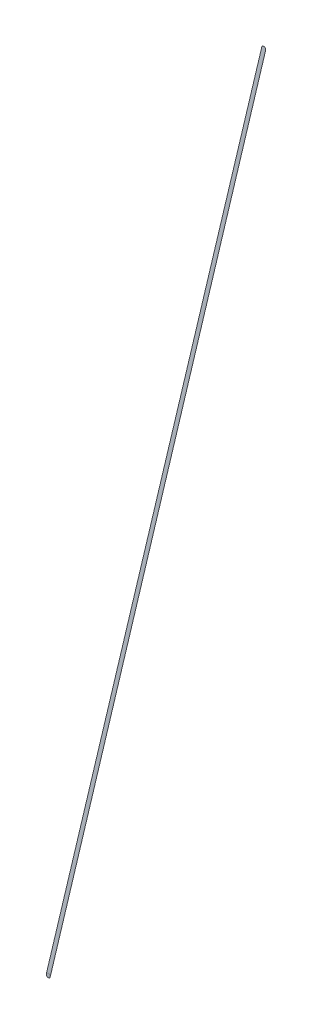
ISO-10303-21;
HEADER;
FILE_DESCRIPTION(('STEP AP214'),'2;1');
FILE_NAME('part.step','',(''),(''),'','','');
FILE_SCHEMA(('AUTOMOTIVE_DESIGN { 1 0 10303 214 1 1 1 1 }'));
ENDSEC;
DATA;
#1=APPLICATION_CONTEXT('core data for automotive mechanical design processes');
#2=APPLICATION_PROTOCOL_DEFINITION('international standard','automotive_design',2000,#1);
#3=PRODUCT_CONTEXT('',#1,'mechanical');
#4=PRODUCT('Part','Part','',(#3));
#5=PRODUCT_RELATED_PRODUCT_CATEGORY('part','',(#4));
#6=PRODUCT_DEFINITION_FORMATION('','',#4);
#7=PRODUCT_DEFINITION_CONTEXT('part definition',#1,'design');
#8=PRODUCT_DEFINITION('design','',#6,#7);
#9=PRODUCT_DEFINITION_SHAPE('','',#8);
#10=(LENGTH_UNIT() NAMED_UNIT(*) SI_UNIT(.MILLI.,.METRE.));
#11=(NAMED_UNIT(*) PLANE_ANGLE_UNIT() SI_UNIT($,.RADIAN.));
#12=(NAMED_UNIT(*) SI_UNIT($,.STERADIAN.) SOLID_ANGLE_UNIT());
#13=UNCERTAINTY_MEASURE_WITH_UNIT(LENGTH_MEASURE(1.E-05),#10,'distance_accuracy_value','');
#14=(GEOMETRIC_REPRESENTATION_CONTEXT(3) GLOBAL_UNCERTAINTY_ASSIGNED_CONTEXT((#13)) GLOBAL_UNIT_ASSIGNED_CONTEXT((#10,
#11,#12)) REPRESENTATION_CONTEXT('',''));
#15=CARTESIAN_POINT('',(0.,0.,0.));
#16=DIRECTION('',(0.,0.,1.));
#17=DIRECTION('',(1.,0.,0.));
#18=AXIS2_PLACEMENT_3D('',#15,#16,#17);
#19=CARTESIAN_POINT('',(0.,-60.,0.));
#20=DIRECTION('',(0.,0.,1.));
#21=DIRECTION('',(1.,0.,0.));
#22=AXIS2_PLACEMENT_3D('',#19,#20,#21);
#23=PLANE('',#22);
#24=CARTESIAN_POINT('',(0.,-60.,0.));
#25=DIRECTION('',(0.,0.,1.));
#26=DIRECTION('',(1.,0.,0.));
#27=AXIS2_PLACEMENT_3D('',#24,#25,#26);
#28=CIRCLE('',#27,5.);
#29=CARTESIAN_POINT('',(5.,-60.,0.));
#30=VERTEX_POINT('',#29);
#31=EDGE_CURVE('E23',#30,#30,#28,.T.);
#32=ORIENTED_EDGE('',*,*,#31,.F.);
#33=EDGE_LOOP('',(#32));
#34=FACE_BOUND('',#33,.T.);
#35=ADVANCED_FACE('F16',(#34),#23,.F.);
#36=CARTESIAN_POINT('',(-351.026829001196,-2168.53308218387,193.94920797693));
#37=DIRECTION('',(0.,0.,1.));
#38=DIRECTION('',(1.,0.,0.));
#39=AXIS2_PLACEMENT_3D('',#36,#37,#38);
#40=PLANE('',#39);
#41=CARTESIAN_POINT('',(-351.026829001196,-2168.53308218387,193.94920797693));
#42=DIRECTION('',(0.,0.,1.));
#43=DIRECTION('',(1.,0.,0.));
#44=AXIS2_PLACEMENT_3D('',#41,#42,#43);
#45=CIRCLE('',#44,5.);
#46=CARTESIAN_POINT('',(-346.026829001196,-2168.53308218387,193.94920797693));
#47=VERTEX_POINT('',#46);
#48=EDGE_CURVE('E11',#47,#47,#45,.T.);
#49=ORIENTED_EDGE('',*,*,#48,.T.);
#50=EDGE_LOOP('',(#49));
#51=FACE_BOUND('',#50,.T.);
#52=ADVANCED_FACE('F30',(#51),#40,.T.);
#53=CARTESIAN_POINT('',(5.,-60.,0.));
#54=CARTESIAN_POINT('',(-346.026829001196,-2168.53308218387,193.94920797693));
#55=CARTESIAN_POINT('',(5.00000000000001,-49.9999999999999,0.));
#56=CARTESIAN_POINT('',(-346.026829001196,-2158.53308218386,193.94920797693));
#57=CARTESIAN_POINT('',(-4.99999999999999,-49.9999999999999,0.));
#58=CARTESIAN_POINT('',(-356.026829001195,-2158.53308218386,193.94920797693));
#59=CARTESIAN_POINT('',(-5.,-60.,0.));
#60=CARTESIAN_POINT('',(-356.026829001196,-2168.53308218387,193.94920797693));
#61=CARTESIAN_POINT('',(-4.99999999999999,-70.,0.));
#62=CARTESIAN_POINT('',(-356.026829001195,-2178.53308218386,193.94920797693));
#63=CARTESIAN_POINT('',(5.00000000000001,-70.,0.));
#64=CARTESIAN_POINT('',(-346.026829001196,-2178.53308218386,193.94920797693));
#65=CARTESIAN_POINT('',(5.,-60.,0.));
#66=CARTESIAN_POINT('',(-346.026829001196,-2168.53308218387,193.94920797693));
#67=(BOUNDED_SURFACE() B_SPLINE_SURFACE(3,1,((#53,#54),(#55,#56),(#57,#58),(#59,#60),(#61,#62),
(#63,#64),(#65,#66)),.UNSPECIFIED.,.T.,.F.,.F.) B_SPLINE_SURFACE_WITH_KNOTS((4,3,4),(2,2),(0.,
0.5,1.),(0.,1.),.UNSPECIFIED.) GEOMETRIC_REPRESENTATION_ITEM() RATIONAL_B_SPLINE_SURFACE(((1.,
1.),(0.333333333333334,0.333333333333334),(0.333333333333334,0.333333333333334),(1.,1.),
(0.333333333333334,0.333333333333334),(0.333333333333334,0.333333333333334),(1.,1.))) REPRESENTATION_ITEM('') SURFACE());
#68=ORIENTED_EDGE('',*,*,#48,.F.);
#69=EDGE_LOOP('',(#68));
#70=FACE_BOUND('',#69,.T.);
#71=ORIENTED_EDGE('',*,*,#31,.T.);
#72=EDGE_LOOP('',(#71));
#73=FACE_BOUND('',#72,.T.);
#74=ADVANCED_FACE('F32',(#70,#73),#67,.T.);
#75=CLOSED_SHELL('',(#35,#52,#74));
#76=MANIFOLD_SOLID_BREP('B1',#75);
#77=ADVANCED_BREP_SHAPE_REPRESENTATION('',(#18,#76),#14);
#78=SHAPE_DEFINITION_REPRESENTATION(#9,#77);
ENDSEC;
END-ISO-10303-21;
